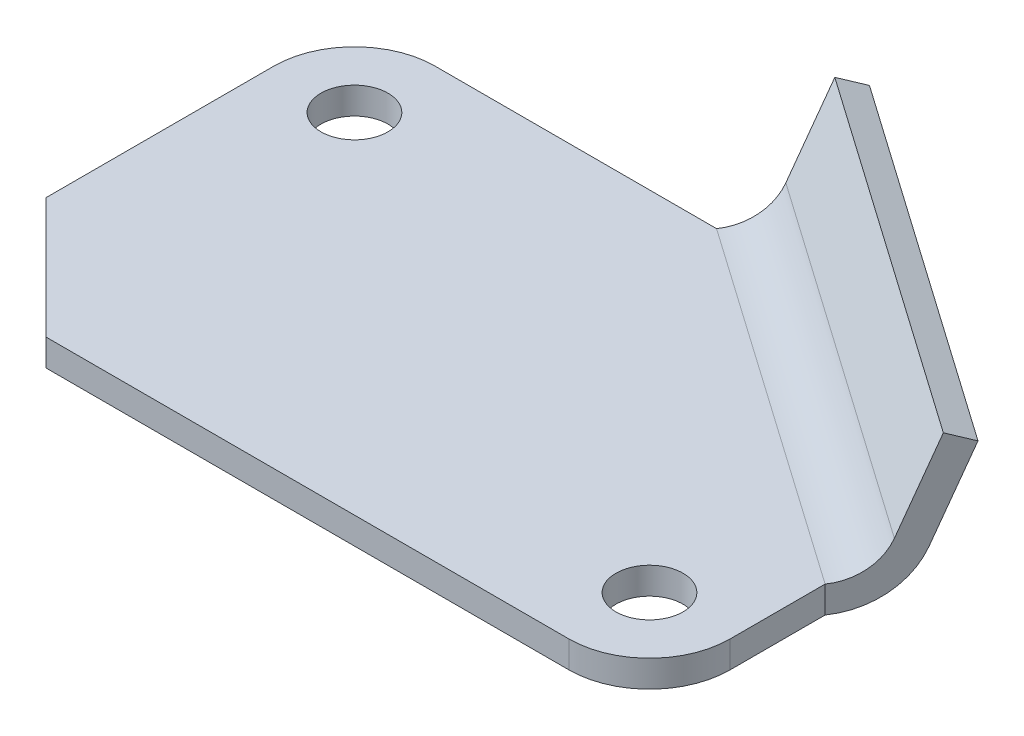
ISO-10303-21;
HEADER;
FILE_DESCRIPTION(('STEP AP214'),'2;1');
FILE_NAME('part.step','',(''),(''),'','','');
FILE_SCHEMA(('AUTOMOTIVE_DESIGN { 1 0 10303 214 1 1 1 1 }'));
ENDSEC;
DATA;
#1=APPLICATION_CONTEXT('core data for automotive mechanical design processes');
#2=APPLICATION_PROTOCOL_DEFINITION('international standard','automotive_design',2000,#1);
#3=PRODUCT_CONTEXT('',#1,'mechanical');
#4=PRODUCT('Part','Part','',(#3));
#5=PRODUCT_RELATED_PRODUCT_CATEGORY('part','',(#4));
#6=PRODUCT_DEFINITION_FORMATION('','',#4);
#7=PRODUCT_DEFINITION_CONTEXT('part definition',#1,'design');
#8=PRODUCT_DEFINITION('design','',#6,#7);
#9=PRODUCT_DEFINITION_SHAPE('','',#8);
#10=(LENGTH_UNIT() NAMED_UNIT(*) SI_UNIT(.MILLI.,.METRE.));
#11=(NAMED_UNIT(*) PLANE_ANGLE_UNIT() SI_UNIT($,.RADIAN.));
#12=(NAMED_UNIT(*) SI_UNIT($,.STERADIAN.) SOLID_ANGLE_UNIT());
#13=UNCERTAINTY_MEASURE_WITH_UNIT(LENGTH_MEASURE(1.E-05),#10,'distance_accuracy_value','');
#14=(GEOMETRIC_REPRESENTATION_CONTEXT(3) GLOBAL_UNCERTAINTY_ASSIGNED_CONTEXT((#13)) GLOBAL_UNIT_ASSIGNED_CONTEXT((#10,
#11,#12)) REPRESENTATION_CONTEXT('',''));
#15=CARTESIAN_POINT('',(0.,0.,0.));
#16=DIRECTION('',(0.,0.,1.));
#17=DIRECTION('',(1.,0.,0.));
#18=AXIS2_PLACEMENT_3D('',#15,#16,#17);
#19=CARTESIAN_POINT('',(84.,4.,40.));
#20=DIRECTION('',(0.,1.,0.));
#21=DIRECTION('',(0.,0.,1.));
#22=AXIS2_PLACEMENT_3D('',#19,#20,#21);
#23=PLANE('',#22);
#24=CARTESIAN_POINT('',(0.,4.,0.));
#25=DIRECTION('',(0.,1.,0.));
#26=DIRECTION('',(0.,0.,1.));
#27=AXIS2_PLACEMENT_3D('',#24,#25,#26);
#28=CIRCLE('',#27,5.);
#29=CARTESIAN_POINT('',(0.,4.,5.));
#30=VERTEX_POINT('',#29);
#31=EDGE_CURVE('E135',#30,#30,#28,.T.);
#32=ORIENTED_EDGE('',*,*,#31,.F.);
#33=EDGE_LOOP('',(#32));
#34=FACE_BOUND('',#33,.T.);
#35=DIRECTION('',(0.707106781186548,0.,0.707106781186547));
#36=VECTOR('',#35,1.);
#37=CARTESIAN_POINT('',(-12.,4.,34.));
#38=LINE('',#37,#36);
#39=CARTESIAN_POINT('',(-12.,4.,34.));
#40=VERTEX_POINT('',#39);
#41=CARTESIAN_POINT('',(6.00000000000001,4.,52.));
#42=VERTEX_POINT('',#41);
#43=EDGE_CURVE('E148',#40,#42,#38,.T.);
#44=ORIENTED_EDGE('',*,*,#43,.T.);
#45=DIRECTION('',(1.,0.,0.));
#46=VECTOR('',#45,1.);
#47=CARTESIAN_POINT('',(6.00000000000001,4.,52.));
#48=LINE('',#47,#46);
#49=CARTESIAN_POINT('',(84.,4.,52.));
#50=VERTEX_POINT('',#49);
#51=EDGE_CURVE('E95',#42,#50,#48,.T.);
#52=ORIENTED_EDGE('',*,*,#51,.T.);
#53=CARTESIAN_POINT('',(84.,4.,40.));
#54=DIRECTION('',(0.,1.,0.));
#55=DIRECTION('',(0.,0.,1.));
#56=AXIS2_PLACEMENT_3D('',#53,#54,#55);
#57=CIRCLE('',#56,12.);
#58=CARTESIAN_POINT('',(96.,4.,40.));
#59=VERTEX_POINT('',#58);
#60=EDGE_CURVE('E163',#50,#59,#57,.T.);
#61=ORIENTED_EDGE('',*,*,#60,.T.);
#62=DIRECTION('',(0.,0.,-1.));
#63=VECTOR('',#62,1.);
#64=CARTESIAN_POINT('',(96.,4.,40.));
#65=LINE('',#64,#63);
#66=CARTESIAN_POINT('',(96.,4.,25.8112070633244));
#67=VERTEX_POINT('',#66);
#68=EDGE_CURVE('E267',#59,#67,#65,.T.);
#69=ORIENTED_EDGE('',*,*,#68,.T.);
#70=DIRECTION('',(-0.819152044288991,0.,-0.573576436351047));
#71=VECTOR('',#70,1.);
#72=CARTESIAN_POINT('',(96.,4.,25.8112070633244));
#73=LINE('',#72,#71);
#74=CARTESIAN_POINT('',(42.,4.,-12.));
#75=VERTEX_POINT('',#74);
#76=EDGE_CURVE('E114',#67,#75,#73,.T.);
#77=ORIENTED_EDGE('',*,*,#76,.T.);
#78=DIRECTION('',(-1.,0.,0.));
#79=VECTOR('',#78,1.);
#80=CARTESIAN_POINT('',(42.,4.,-12.));
#81=LINE('',#80,#79);
#82=CARTESIAN_POINT('',(0.,4.,-12.));
#83=VERTEX_POINT('',#82);
#84=EDGE_CURVE('E106',#75,#83,#81,.T.);
#85=ORIENTED_EDGE('',*,*,#84,.T.);
#86=CARTESIAN_POINT('',(0.,4.,0.));
#87=DIRECTION('',(0.,1.,0.));
#88=DIRECTION('',(0.,0.,1.));
#89=AXIS2_PLACEMENT_3D('',#86,#87,#88);
#90=CIRCLE('',#89,12.);
#91=CARTESIAN_POINT('',(-12.,4.,0.));
#92=VERTEX_POINT('',#91);
#93=EDGE_CURVE('E110',#83,#92,#90,.T.);
#94=ORIENTED_EDGE('',*,*,#93,.T.);
#95=DIRECTION('',(0.,0.,1.));
#96=VECTOR('',#95,1.);
#97=CARTESIAN_POINT('',(-12.,4.,0.));
#98=LINE('',#97,#96);
#99=EDGE_CURVE('E54',#92,#40,#98,.T.);
#100=ORIENTED_EDGE('',*,*,#99,.T.);
#101=EDGE_LOOP('',(#44,#52,#61,#69,#77,#85,#94,#100));
#102=FACE_BOUND('',#101,.T.);
#103=CARTESIAN_POINT('',(84.,4.,40.));
#104=DIRECTION('',(0.,1.,0.));
#105=DIRECTION('',(0.,0.,1.));
#106=AXIS2_PLACEMENT_3D('',#103,#104,#105);
#107=CIRCLE('',#106,4.99999999999999);
#108=CARTESIAN_POINT('',(84.,4.,45.));
#109=VERTEX_POINT('',#108);
#110=EDGE_CURVE('E254',#109,#109,#107,.T.);
#111=ORIENTED_EDGE('',*,*,#110,.F.);
#112=EDGE_LOOP('',(#111));
#113=FACE_BOUND('',#112,.T.);
#114=ADVANCED_FACE('F37',(#34,#102,#113),#23,.T.);
#115=CARTESIAN_POINT('',(84.,0.,40.));
#116=DIRECTION('',(0.,1.,0.));
#117=DIRECTION('',(0.,0.,1.));
#118=AXIS2_PLACEMENT_3D('',#115,#116,#117);
#119=PLANE('',#118);
#120=DIRECTION('',(0.707106781186548,0.,0.707106781186547));
#121=VECTOR('',#120,1.);
#122=CARTESIAN_POINT('',(-12.,0.,34.));
#123=LINE('',#122,#121);
#124=CARTESIAN_POINT('',(-12.,0.,34.));
#125=VERTEX_POINT('',#124);
#126=CARTESIAN_POINT('',(6.00000000000001,0.,52.));
#127=VERTEX_POINT('',#126);
#128=EDGE_CURVE('E131',#125,#127,#123,.T.);
#129=ORIENTED_EDGE('',*,*,#128,.F.);
#130=DIRECTION('',(0.,0.,1.));
#131=VECTOR('',#130,1.);
#132=CARTESIAN_POINT('',(-12.,0.,0.));
#133=LINE('',#132,#131);
#134=CARTESIAN_POINT('',(-12.,0.,0.));
#135=VERTEX_POINT('',#134);
#136=EDGE_CURVE('E87',#135,#125,#133,.T.);
#137=ORIENTED_EDGE('',*,*,#136,.F.);
#138=CARTESIAN_POINT('',(0.,0.,0.));
#139=DIRECTION('',(0.,1.,0.));
#140=DIRECTION('',(0.,0.,1.));
#141=AXIS2_PLACEMENT_3D('',#138,#139,#140);
#142=CIRCLE('',#141,12.);
#143=CARTESIAN_POINT('',(0.,0.,-12.));
#144=VERTEX_POINT('',#143);
#145=EDGE_CURVE('E81',#144,#135,#142,.T.);
#146=ORIENTED_EDGE('',*,*,#145,.F.);
#147=DIRECTION('',(-1.,0.,0.));
#148=VECTOR('',#147,1.);
#149=CARTESIAN_POINT('',(42.,0.,-12.));
#150=LINE('',#149,#148);
#151=CARTESIAN_POINT('',(42.,0.,-12.));
#152=VERTEX_POINT('',#151);
#153=EDGE_CURVE('E121',#152,#144,#150,.T.);
#154=ORIENTED_EDGE('',*,*,#153,.F.);
#155=DIRECTION('',(-0.819152044288991,0.,-0.573576436351047));
#156=VECTOR('',#155,1.);
#157=CARTESIAN_POINT('',(96.,0.,25.8112070633244));
#158=LINE('',#157,#156);
#159=CARTESIAN_POINT('',(96.,0.,25.8112070633244));
#160=VERTEX_POINT('',#159);
#161=EDGE_CURVE('E142',#160,#152,#158,.T.);
#162=ORIENTED_EDGE('',*,*,#161,.F.);
#163=DIRECTION('',(0.,0.,-1.));
#164=VECTOR('',#163,1.);
#165=CARTESIAN_POINT('',(96.,0.,40.));
#166=LINE('',#165,#164);
#167=CARTESIAN_POINT('',(96.,0.,40.));
#168=VERTEX_POINT('',#167);
#169=EDGE_CURVE('E139',#168,#160,#166,.T.);
#170=ORIENTED_EDGE('',*,*,#169,.F.);
#171=CARTESIAN_POINT('',(84.,0.,40.));
#172=DIRECTION('',(0.,1.,0.));
#173=DIRECTION('',(0.,0.,1.));
#174=AXIS2_PLACEMENT_3D('',#171,#172,#173);
#175=CIRCLE('',#174,12.);
#176=CARTESIAN_POINT('',(84.,0.,52.));
#177=VERTEX_POINT('',#176);
#178=EDGE_CURVE('E137',#177,#168,#175,.T.);
#179=ORIENTED_EDGE('',*,*,#178,.F.);
#180=DIRECTION('',(1.,0.,0.));
#181=VECTOR('',#180,1.);
#182=CARTESIAN_POINT('',(6.00000000000001,0.,52.));
#183=LINE('',#182,#181);
#184=EDGE_CURVE('E134',#127,#177,#183,.T.);
#185=ORIENTED_EDGE('',*,*,#184,.F.);
#186=EDGE_LOOP('',(#129,#137,#146,#154,#162,#170,#179,#185));
#187=FACE_BOUND('',#186,.T.);
#188=CARTESIAN_POINT('',(0.,0.,0.));
#189=DIRECTION('',(0.,1.,0.));
#190=DIRECTION('',(0.,0.,1.));
#191=AXIS2_PLACEMENT_3D('',#188,#189,#190);
#192=CIRCLE('',#191,5.);
#193=CARTESIAN_POINT('',(0.,0.,5.));
#194=VERTEX_POINT('',#193);
#195=EDGE_CURVE('E257',#194,#194,#192,.T.);
#196=ORIENTED_EDGE('',*,*,#195,.T.);
#197=EDGE_LOOP('',(#196));
#198=FACE_BOUND('',#197,.T.);
#199=CARTESIAN_POINT('',(84.,0.,40.));
#200=DIRECTION('',(0.,1.,0.));
#201=DIRECTION('',(0.,0.,1.));
#202=AXIS2_PLACEMENT_3D('',#199,#200,#201);
#203=CIRCLE('',#202,4.99999999999999);
#204=CARTESIAN_POINT('',(84.,0.,45.));
#205=VERTEX_POINT('',#204);
#206=EDGE_CURVE('E250',#205,#205,#203,.T.);
#207=ORIENTED_EDGE('',*,*,#206,.T.);
#208=EDGE_LOOP('',(#207));
#209=FACE_BOUND('',#208,.T.);
#210=ADVANCED_FACE('F167',(#187,#198,#209),#119,.F.);
#211=CARTESIAN_POINT('',(-12.,4.,34.));
#212=DIRECTION('',(0.707106781186547,0.,-0.707106781186548));
#213=DIRECTION('',(-0.707106781186548,0.,-0.707106781186547));
#214=AXIS2_PLACEMENT_3D('',#211,#212,#213);
#215=PLANE('',#214);
#216=ORIENTED_EDGE('',*,*,#128,.T.);
#217=DIRECTION('',(0.,-1.,0.));
#218=VECTOR('',#217,1.);
#219=CARTESIAN_POINT('',(6.00000000000001,4.,52.));
#220=LINE('',#219,#218);
#221=EDGE_CURVE('E11',#42,#127,#220,.T.);
#222=ORIENTED_EDGE('',*,*,#221,.F.);
#223=ORIENTED_EDGE('',*,*,#43,.F.);
#224=DIRECTION('',(0.,-1.,0.));
#225=VECTOR('',#224,1.);
#226=CARTESIAN_POINT('',(-12.,4.,34.));
#227=LINE('',#226,#225);
#228=EDGE_CURVE('E127',#40,#125,#227,.T.);
#229=ORIENTED_EDGE('',*,*,#228,.T.);
#230=EDGE_LOOP('',(#216,#222,#223,#229));
#231=FACE_BOUND('',#230,.T.);
#232=ADVANCED_FACE('F39',(#231),#215,.F.);
#233=CARTESIAN_POINT('',(6.00000000000001,4.,52.));
#234=DIRECTION('',(0.,0.,-1.));
#235=DIRECTION('',(-1.,0.,0.));
#236=AXIS2_PLACEMENT_3D('',#233,#234,#235);
#237=PLANE('',#236);
#238=ORIENTED_EDGE('',*,*,#184,.T.);
#239=DIRECTION('',(0.,-1.,0.));
#240=VECTOR('',#239,1.);
#241=CARTESIAN_POINT('',(84.,4.,52.));
#242=LINE('',#241,#240);
#243=EDGE_CURVE('E46',#50,#177,#242,.T.);
#244=ORIENTED_EDGE('',*,*,#243,.F.);
#245=ORIENTED_EDGE('',*,*,#51,.F.);
#246=ORIENTED_EDGE('',*,*,#221,.T.);
#247=EDGE_LOOP('',(#238,#244,#245,#246));
#248=FACE_BOUND('',#247,.T.);
#249=ADVANCED_FACE('F271',(#248),#237,.F.);
#250=CARTESIAN_POINT('',(84.,4.,40.));
#251=DIRECTION('',(0.,-1.,0.));
#252=DIRECTION('',(0.,0.,-1.));
#253=AXIS2_PLACEMENT_3D('',#250,#251,#252);
#254=CYLINDRICAL_SURFACE('',#253,12.);
#255=ORIENTED_EDGE('',*,*,#178,.T.);
#256=DIRECTION('',(0.,-1.,0.));
#257=VECTOR('',#256,1.);
#258=CARTESIAN_POINT('',(96.,4.,40.));
#259=LINE('',#258,#257);
#260=EDGE_CURVE('E155',#59,#168,#259,.T.);
#261=ORIENTED_EDGE('',*,*,#260,.F.);
#262=ORIENTED_EDGE('',*,*,#60,.F.);
#263=ORIENTED_EDGE('',*,*,#243,.T.);
#264=EDGE_LOOP('',(#255,#261,#262,#263));
#265=FACE_BOUND('',#264,.T.);
#266=ADVANCED_FACE('F161',(#265),#254,.T.);
#267=CARTESIAN_POINT('',(96.,4.,40.));
#268=DIRECTION('',(-1.,0.,0.));
#269=DIRECTION('',(0.,0.,1.));
#270=AXIS2_PLACEMENT_3D('',#267,#268,#269);
#271=PLANE('',#270);
#272=ORIENTED_EDGE('',*,*,#169,.T.);
#273=DIRECTION('',(0.,-1.,0.));
#274=VECTOR('',#273,1.);
#275=CARTESIAN_POINT('',(96.,4.,25.8112070633244));
#276=LINE('',#275,#274);
#277=EDGE_CURVE('E152',#67,#160,#276,.T.);
#278=ORIENTED_EDGE('',*,*,#277,.F.);
#279=ORIENTED_EDGE('',*,*,#68,.F.);
#280=ORIENTED_EDGE('',*,*,#260,.T.);
#281=EDGE_LOOP('',(#272,#278,#279,#280));
#282=FACE_BOUND('',#281,.T.);
#283=ADVANCED_FACE('F173',(#282),#271,.F.);
#284=CARTESIAN_POINT('',(42.,4.,-12.));
#285=DIRECTION('',(0.,0.,1.));
#286=DIRECTION('',(1.,0.,0.));
#287=AXIS2_PLACEMENT_3D('',#284,#285,#286);
#288=PLANE('',#287);
#289=ORIENTED_EDGE('',*,*,#153,.T.);
#290=DIRECTION('',(0.,-1.,0.));
#291=VECTOR('',#290,1.);
#292=CARTESIAN_POINT('',(0.,4.,-12.));
#293=LINE('',#292,#291);
#294=EDGE_CURVE('E118',#83,#144,#293,.T.);
#295=ORIENTED_EDGE('',*,*,#294,.F.);
#296=ORIENTED_EDGE('',*,*,#84,.F.);
#297=DIRECTION('',(0.,-1.,0.));
#298=VECTOR('',#297,1.);
#299=CARTESIAN_POINT('',(42.,4.,-12.));
#300=LINE('',#299,#298);
#301=EDGE_CURVE('E122',#75,#152,#300,.T.);
#302=ORIENTED_EDGE('',*,*,#301,.T.);
#303=EDGE_LOOP('',(#289,#295,#296,#302));
#304=FACE_BOUND('',#303,.T.);
#305=ADVANCED_FACE('F119',(#304),#288,.F.);
#306=CARTESIAN_POINT('',(0.,4.,0.));
#307=DIRECTION('',(0.,-1.,0.));
#308=DIRECTION('',(0.,0.,-1.));
#309=AXIS2_PLACEMENT_3D('',#306,#307,#308);
#310=CYLINDRICAL_SURFACE('',#309,12.);
#311=ORIENTED_EDGE('',*,*,#145,.T.);
#312=DIRECTION('',(0.,-1.,0.));
#313=VECTOR('',#312,1.);
#314=CARTESIAN_POINT('',(-12.,4.,0.));
#315=LINE('',#314,#313);
#316=EDGE_CURVE('E123',#92,#135,#315,.T.);
#317=ORIENTED_EDGE('',*,*,#316,.F.);
#318=ORIENTED_EDGE('',*,*,#93,.F.);
#319=ORIENTED_EDGE('',*,*,#294,.T.);
#320=EDGE_LOOP('',(#311,#317,#318,#319));
#321=FACE_BOUND('',#320,.T.);
#322=ADVANCED_FACE('F125',(#321),#310,.T.);
#323=CARTESIAN_POINT('',(-12.,4.,0.));
#324=DIRECTION('',(1.,0.,0.));
#325=DIRECTION('',(0.,0.,-1.));
#326=AXIS2_PLACEMENT_3D('',#323,#324,#325);
#327=PLANE('',#326);
#328=ORIENTED_EDGE('',*,*,#136,.T.);
#329=ORIENTED_EDGE('',*,*,#228,.F.);
#330=ORIENTED_EDGE('',*,*,#99,.F.);
#331=ORIENTED_EDGE('',*,*,#316,.T.);
#332=EDGE_LOOP('',(#328,#329,#330,#331));
#333=FACE_BOUND('',#332,.T.);
#334=ADVANCED_FACE('F290',(#333),#327,.F.);
#335=CARTESIAN_POINT('',(0.,4.,0.));
#336=DIRECTION('',(0.,-1.,0.));
#337=DIRECTION('',(0.,0.,-1.));
#338=AXIS2_PLACEMENT_3D('',#335,#336,#337);
#339=CYLINDRICAL_SURFACE('',#338,5.);
#340=ORIENTED_EDGE('',*,*,#31,.T.);
#341=EDGE_LOOP('',(#340));
#342=FACE_BOUND('',#341,.T.);
#343=ORIENTED_EDGE('',*,*,#195,.F.);
#344=EDGE_LOOP('',(#343));
#345=FACE_BOUND('',#344,.T.);
#346=ADVANCED_FACE('F287',(#342,#345),#339,.F.);
#347=CARTESIAN_POINT('',(84.,4.,40.));
#348=DIRECTION('',(0.,-1.,0.));
#349=DIRECTION('',(0.,0.,-1.));
#350=AXIS2_PLACEMENT_3D('',#347,#348,#349);
#351=CYLINDRICAL_SURFACE('',#350,4.99999999999999);
#352=ORIENTED_EDGE('',*,*,#110,.T.);
#353=EDGE_LOOP('',(#352));
#354=FACE_BOUND('',#353,.T.);
#355=ORIENTED_EDGE('',*,*,#206,.F.);
#356=EDGE_LOOP('',(#355));
#357=FACE_BOUND('',#356,.T.);
#358=ADVANCED_FACE('F322',(#354,#357),#351,.F.);
#359=CARTESIAN_POINT('',(51.3898469421272,20.485294842944,-25.4100911940125));
#360=DIRECTION('',(0.531810811144644,-0.374606593415917,-0.759504549900129));
#361=DIRECTION('',(-0.819152044288991,0.,-0.573576436351047));
#362=AXIS2_PLACEMENT_3D('',#359,#360,#361);
#363=PLANE('',#362);
#364=DIRECTION('',(0.214865514885107,0.927183854566786,-0.306859756800783));
#365=VECTOR('',#364,1.);
#366=CARTESIAN_POINT('',(105.389846942127,20.485294842944,12.4011158693119));
#367=LINE('',#366,#365);
#368=CARTESIAN_POINT('',(102.381729733736,7.504720879009,16.6971524645229));
#369=VERTEX_POINT('',#368);
#370=CARTESIAN_POINT('',(105.389846942127,20.485294842944,12.4011158693119));
#371=VERTEX_POINT('',#370);
#372=EDGE_CURVE('E242',#369,#371,#367,.T.);
#373=ORIENTED_EDGE('',*,*,#372,.F.);
#374=DIRECTION('',(0.819152044288991,0.,0.573576436351047));
#375=VECTOR('',#374,1.);
#376=CARTESIAN_POINT('',(48.3817297337357,7.504720879009,-21.1140545988015));
#377=LINE('',#376,#375);
#378=CARTESIAN_POINT('',(48.3817297337357,7.504720879009,-21.1140545988015));
#379=VERTEX_POINT('',#378);
#380=EDGE_CURVE('E231',#379,#369,#377,.T.);
#381=ORIENTED_EDGE('',*,*,#380,.F.);
#382=DIRECTION('',(0.214865514885107,0.927183854566786,-0.306859756800783));
#383=VECTOR('',#382,1.);
#384=CARTESIAN_POINT('',(51.3898469421272,20.485294842944,-25.4100911940125));
#385=LINE('',#384,#383);
#386=CARTESIAN_POINT('',(51.3898469421272,20.485294842944,-25.4100911940125));
#387=VERTEX_POINT('',#386);
#388=EDGE_CURVE('E224',#379,#387,#385,.T.);
#389=ORIENTED_EDGE('',*,*,#388,.T.);
#390=DIRECTION('',(0.819152044288991,0.,0.573576436351047));
#391=VECTOR('',#390,1.);
#392=CARTESIAN_POINT('',(51.3898469421272,20.485294842944,-25.4100911940125));
#393=LINE('',#392,#391);
#394=EDGE_CURVE('E207',#387,#371,#393,.T.);
#395=ORIENTED_EDGE('',*,*,#394,.T.);
#396=EDGE_LOOP('',(#373,#381,#389,#395));
#397=FACE_BOUND('',#396,.T.);
#398=ADVANCED_FACE('F230',(#397),#363,.T.);
#399=CARTESIAN_POINT('',(42.,12.,-12.));
#400=DIRECTION('',(0.819152044288991,0.,0.573576436351047));
#401=DIRECTION('',(0.573576436351047,0.,-0.819152044288991));
#402=AXIS2_PLACEMENT_3D('',#399,#400,#401);
#403=CYLINDRICAL_SURFACE('',#402,12.);
#404=CARTESIAN_POINT('',(96.,12.,25.8112070633244));
#405=DIRECTION('',(0.819152044288991,0.,0.573576436351047));
#406=DIRECTION('',(-0.573576436351047,0.,0.819152044288991));
#407=AXIS2_PLACEMENT_3D('',#404,#405,#406);
#408=CIRCLE('',#407,12.);
#409=EDGE_CURVE('E232',#160,#369,#408,.T.);
#410=ORIENTED_EDGE('',*,*,#409,.F.);
#411=ORIENTED_EDGE('',*,*,#161,.T.);
#412=CARTESIAN_POINT('',(42.,12.,-12.));
#413=DIRECTION('',(0.819152044288991,0.,0.573576436351047));
#414=DIRECTION('',(-0.573576436351047,0.,0.819152044288991));
#415=AXIS2_PLACEMENT_3D('',#412,#413,#414);
#416=CIRCLE('',#415,12.);
#417=EDGE_CURVE('E218',#152,#379,#416,.T.);
#418=ORIENTED_EDGE('',*,*,#417,.T.);
#419=ORIENTED_EDGE('',*,*,#380,.T.);
#420=EDGE_LOOP('',(#410,#411,#418,#419));
#421=FACE_BOUND('',#420,.T.);
#422=ADVANCED_FACE('F334',(#421),#403,.T.);
#423=CARTESIAN_POINT('',(42.,12.,-12.));
#424=DIRECTION('',(0.819152044288991,0.,0.573576436351047));
#425=DIRECTION('',(0.573576436351047,0.,-0.819152044288991));
#426=AXIS2_PLACEMENT_3D('',#423,#424,#425);
#427=CYLINDRICAL_SURFACE('',#426,7.99999999999999);
#428=CARTESIAN_POINT('',(96.,12.,25.8112070633244));
#429=DIRECTION('',(-0.819152044288991,0.,-0.573576436351047));
#430=DIRECTION('',(-0.573576436351047,0.,0.819152044288991));
#431=AXIS2_PLACEMENT_3D('',#428,#429,#430);
#432=CIRCLE('',#431,7.99999999999999);
#433=CARTESIAN_POINT('',(100.254486489157,9.00314725267267,19.7351706641234));
#434=VERTEX_POINT('',#433);
#435=EDGE_CURVE('E234',#434,#67,#432,.T.);
#436=ORIENTED_EDGE('',*,*,#435,.F.);
#437=DIRECTION('',(0.819152044288991,0.,0.573576436351047));
#438=VECTOR('',#437,1.);
#439=CARTESIAN_POINT('',(46.2544864891571,9.00314725267267,-18.076036399201));
#440=LINE('',#439,#438);
#441=CARTESIAN_POINT('',(46.2544864891571,9.00314725267267,-18.076036399201));
#442=VERTEX_POINT('',#441);
#443=EDGE_CURVE('E251',#442,#434,#440,.T.);
#444=ORIENTED_EDGE('',*,*,#443,.F.);
#445=CARTESIAN_POINT('',(42.,12.,-12.));
#446=DIRECTION('',(-0.819152044288991,0.,-0.573576436351047));
#447=DIRECTION('',(-0.573576436351047,0.,0.819152044288991));
#448=AXIS2_PLACEMENT_3D('',#445,#446,#447);
#449=CIRCLE('',#448,7.99999999999999);
#450=EDGE_CURVE('E238',#442,#75,#449,.T.);
#451=ORIENTED_EDGE('',*,*,#450,.T.);
#452=ORIENTED_EDGE('',*,*,#76,.F.);
#453=EDGE_LOOP('',(#436,#444,#451,#452));
#454=FACE_BOUND('',#453,.T.);
#455=ADVANCED_FACE('F341',(#454),#427,.F.);
#456=CARTESIAN_POINT('',(49.2626036975486,21.9837212166076,-22.372072994412));
#457=DIRECTION('',(-0.531810811144644,0.374606593415917,0.759504549900129));
#458=DIRECTION('',(0.819152044288991,0.,0.573576436351047));
#459=AXIS2_PLACEMENT_3D('',#456,#457,#458);
#460=PLANE('',#459);
#461=DIRECTION('',(-0.214865514885108,-0.927183854566785,0.306859756800783));
#462=VECTOR('',#461,1.);
#463=CARTESIAN_POINT('',(103.262603697549,21.9837212166076,15.4391340689124));
#464=LINE('',#463,#462);
#465=CARTESIAN_POINT('',(103.262603697549,21.9837212166076,15.4391340689124));
#466=VERTEX_POINT('',#465);
#467=EDGE_CURVE('E245',#466,#434,#464,.T.);
#468=ORIENTED_EDGE('',*,*,#467,.F.);
#469=DIRECTION('',(0.819152044288991,0.,0.573576436351047));
#470=VECTOR('',#469,1.);
#471=CARTESIAN_POINT('',(49.2626036975486,21.9837212166076,-22.372072994412));
#472=LINE('',#471,#470);
#473=CARTESIAN_POINT('',(49.2626036975486,21.9837212166076,-22.372072994412));
#474=VERTEX_POINT('',#473);
#475=EDGE_CURVE('E217',#474,#466,#472,.T.);
#476=ORIENTED_EDGE('',*,*,#475,.F.);
#477=DIRECTION('',(-0.214865514885108,-0.927183854566785,0.306859756800783));
#478=VECTOR('',#477,1.);
#479=CARTESIAN_POINT('',(49.2626036975486,21.9837212166076,-22.372072994412));
#480=LINE('',#479,#478);
#481=EDGE_CURVE('E228',#474,#442,#480,.T.);
#482=ORIENTED_EDGE('',*,*,#481,.T.);
#483=ORIENTED_EDGE('',*,*,#443,.T.);
#484=EDGE_LOOP('',(#468,#476,#482,#483));
#485=FACE_BOUND('',#484,.T.);
#486=ADVANCED_FACE('F349',(#485),#460,.T.);
#487=CARTESIAN_POINT('',(51.3898469421272,20.485294842944,-25.4100911940125));
#488=DIRECTION('',(0.214865514885107,0.927183854566786,-0.306859756800783));
#489=DIRECTION('',(0.,0.314198283252718,0.949357382022726));
#490=AXIS2_PLACEMENT_3D('',#487,#488,#489);
#491=PLANE('',#490);
#492=DIRECTION('',(-0.531810811144642,0.374606593415917,0.75950454990013));
#493=VECTOR('',#492,1.);
#494=CARTESIAN_POINT('',(105.389846942127,20.485294842944,12.4011158693119));
#495=LINE('',#494,#493);
#496=EDGE_CURVE('E212',#371,#466,#495,.T.);
#497=ORIENTED_EDGE('',*,*,#496,.F.);
#498=ORIENTED_EDGE('',*,*,#394,.F.);
#499=DIRECTION('',(-0.531810811144642,0.374606593415917,0.75950454990013));
#500=VECTOR('',#499,1.);
#501=CARTESIAN_POINT('',(51.3898469421272,20.485294842944,-25.4100911940125));
#502=LINE('',#501,#500);
#503=EDGE_CURVE('E210',#387,#474,#502,.T.);
#504=ORIENTED_EDGE('',*,*,#503,.T.);
#505=ORIENTED_EDGE('',*,*,#475,.T.);
#506=EDGE_LOOP('',(#497,#498,#504,#505));
#507=FACE_BOUND('',#506,.T.);
#508=ADVANCED_FACE('F209',(#507),#491,.T.);
#509=CARTESIAN_POINT('',(42.,12.,-12.));
#510=DIRECTION('',(-0.819152044288991,0.,-0.573576436351047));
#511=DIRECTION('',(-0.573576436351047,0.,0.819152044288991));
#512=AXIS2_PLACEMENT_3D('',#509,#510,#511);
#513=PLANE('',#512);
#514=ORIENTED_EDGE('',*,*,#388,.F.);
#515=ORIENTED_EDGE('',*,*,#417,.F.);
#516=ORIENTED_EDGE('',*,*,#301,.F.);
#517=ORIENTED_EDGE('',*,*,#450,.F.);
#518=ORIENTED_EDGE('',*,*,#481,.F.);
#519=ORIENTED_EDGE('',*,*,#503,.F.);
#520=EDGE_LOOP('',(#514,#515,#516,#517,#518,#519));
#521=FACE_BOUND('',#520,.T.);
#522=ADVANCED_FACE('F223',(#521),#513,.T.);
#523=CARTESIAN_POINT('',(96.,12.,25.8112070633244));
#524=DIRECTION('',(-0.819152044288991,0.,-0.573576436351047));
#525=DIRECTION('',(-0.573576436351047,0.,0.819152044288991));
#526=AXIS2_PLACEMENT_3D('',#523,#524,#525);
#527=PLANE('',#526);
#528=ORIENTED_EDGE('',*,*,#372,.T.);
#529=ORIENTED_EDGE('',*,*,#496,.T.);
#530=ORIENTED_EDGE('',*,*,#467,.T.);
#531=ORIENTED_EDGE('',*,*,#435,.T.);
#532=ORIENTED_EDGE('',*,*,#277,.T.);
#533=ORIENTED_EDGE('',*,*,#409,.T.);
#534=EDGE_LOOP('',(#528,#529,#530,#531,#532,#533));
#535=FACE_BOUND('',#534,.T.);
#536=ADVANCED_FACE('F370',(#535),#527,.F.);
#537=CLOSED_SHELL('',(#114,#210,#232,#249,#266,#283,#305,#322,#334,#346,#358,#398,#422,#455,
#486,#508,#522,#536));
#538=MANIFOLD_SOLID_BREP('B2',#537);
#539=ADVANCED_BREP_SHAPE_REPRESENTATION('',(#18,#538),#14);
#540=SHAPE_DEFINITION_REPRESENTATION(#9,#539);
ENDSEC;
END-ISO-10303-21;
